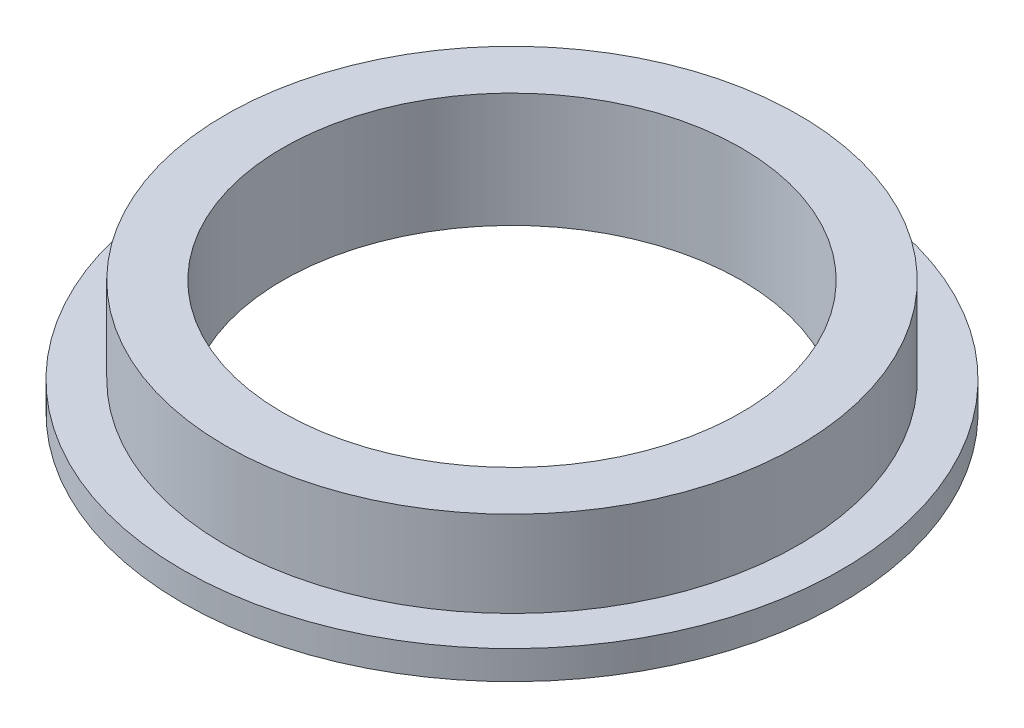
ISO-10303-21;
HEADER;
FILE_DESCRIPTION(('STEP AP214'),'2;1');
FILE_NAME('part.step','',(''),(''),'','','');
FILE_SCHEMA(('AUTOMOTIVE_DESIGN { 1 0 10303 214 1 1 1 1 }'));
ENDSEC;
DATA;
#1=APPLICATION_CONTEXT('core data for automotive mechanical design processes');
#2=APPLICATION_PROTOCOL_DEFINITION('international standard','automotive_design',2000,#1);
#3=PRODUCT_CONTEXT('',#1,'mechanical');
#4=PRODUCT('Part','Part','',(#3));
#5=PRODUCT_RELATED_PRODUCT_CATEGORY('part','',(#4));
#6=PRODUCT_DEFINITION_FORMATION('','',#4);
#7=PRODUCT_DEFINITION_CONTEXT('part definition',#1,'design');
#8=PRODUCT_DEFINITION('design','',#6,#7);
#9=PRODUCT_DEFINITION_SHAPE('','',#8);
#10=(LENGTH_UNIT() NAMED_UNIT(*) SI_UNIT(.MILLI.,.METRE.));
#11=(NAMED_UNIT(*) PLANE_ANGLE_UNIT() SI_UNIT($,.RADIAN.));
#12=(NAMED_UNIT(*) SI_UNIT($,.STERADIAN.) SOLID_ANGLE_UNIT());
#13=UNCERTAINTY_MEASURE_WITH_UNIT(LENGTH_MEASURE(1.E-05),#10,'distance_accuracy_value','');
#14=(GEOMETRIC_REPRESENTATION_CONTEXT(3) GLOBAL_UNCERTAINTY_ASSIGNED_CONTEXT((#13)) GLOBAL_UNIT_ASSIGNED_CONTEXT((#10,
#11,#12)) REPRESENTATION_CONTEXT('',''));
#15=CARTESIAN_POINT('',(0.,0.,0.));
#16=DIRECTION('',(0.,0.,1.));
#17=DIRECTION('',(1.,0.,0.));
#18=AXIS2_PLACEMENT_3D('',#15,#16,#17);
#19=CARTESIAN_POINT('',(0.,25.4,0.));
#20=DIRECTION('',(0.,-1.,0.));
#21=DIRECTION('',(0.,0.,-1.));
#22=AXIS2_PLACEMENT_3D('',#19,#20,#21);
#23=CYLINDRICAL_SURFACE('',#22,15.875);
#24=CARTESIAN_POINT('',(0.,1.5875,0.));
#25=DIRECTION('',(0.,1.,0.));
#26=DIRECTION('',(0.,0.,1.));
#27=AXIS2_PLACEMENT_3D('',#24,#25,#26);
#28=CIRCLE('',#27,15.875);
#29=CARTESIAN_POINT('',(0.,1.5875,15.875));
#30=VERTEX_POINT('',#29);
#31=EDGE_CURVE('E61',#30,#30,#28,.T.);
#32=ORIENTED_EDGE('',*,*,#31,.T.);
#33=EDGE_LOOP('',(#32));
#34=FACE_BOUND('',#33,.T.);
#35=CARTESIAN_POINT('',(0.,6.35,0.));
#36=DIRECTION('',(0.,1.,0.));
#37=DIRECTION('',(0.,0.,1.));
#38=AXIS2_PLACEMENT_3D('',#35,#36,#37);
#39=CIRCLE('',#38,15.875);
#40=CARTESIAN_POINT('',(0.,6.35,15.875));
#41=VERTEX_POINT('',#40);
#42=EDGE_CURVE('E66',#41,#41,#39,.T.);
#43=ORIENTED_EDGE('',*,*,#42,.F.);
#44=EDGE_LOOP('',(#43));
#45=FACE_BOUND('',#44,.T.);
#46=ADVANCED_FACE('F41',(#34,#45),#23,.T.);
#47=CARTESIAN_POINT('',(0.,25.4,0.));
#48=DIRECTION('',(0.,-1.,0.));
#49=DIRECTION('',(0.,0.,-1.));
#50=AXIS2_PLACEMENT_3D('',#47,#48,#49);
#51=CYLINDRICAL_SURFACE('',#50,12.7);
#52=CARTESIAN_POINT('',(0.,0.,0.));
#53=DIRECTION('',(0.,1.,0.));
#54=DIRECTION('',(0.,0.,1.));
#55=AXIS2_PLACEMENT_3D('',#52,#53,#54);
#56=CIRCLE('',#55,12.7);
#57=CARTESIAN_POINT('',(0.,0.,12.7));
#58=VERTEX_POINT('',#57);
#59=EDGE_CURVE('E12',#58,#58,#56,.T.);
#60=ORIENTED_EDGE('',*,*,#59,.F.);
#61=EDGE_LOOP('',(#60));
#62=FACE_BOUND('',#61,.T.);
#63=CARTESIAN_POINT('',(0.,6.35,0.));
#64=DIRECTION('',(0.,1.,0.));
#65=DIRECTION('',(0.,0.,1.));
#66=AXIS2_PLACEMENT_3D('',#63,#64,#65);
#67=CIRCLE('',#66,12.7);
#68=CARTESIAN_POINT('',(0.,6.35,12.7));
#69=VERTEX_POINT('',#68);
#70=EDGE_CURVE('E44',#69,#69,#67,.T.);
#71=ORIENTED_EDGE('',*,*,#70,.T.);
#72=EDGE_LOOP('',(#71));
#73=FACE_BOUND('',#72,.T.);
#74=ADVANCED_FACE('F73',(#62,#73),#51,.F.);
#75=CARTESIAN_POINT('',(0.,0.,0.));
#76=DIRECTION('',(0.,1.,0.));
#77=DIRECTION('',(0.,0.,1.));
#78=AXIS2_PLACEMENT_3D('',#75,#76,#77);
#79=PLANE('',#78);
#80=ORIENTED_EDGE('',*,*,#59,.T.);
#81=EDGE_LOOP('',(#80));
#82=FACE_BOUND('',#81,.T.);
#83=CARTESIAN_POINT('',(0.,0.,0.));
#84=DIRECTION('',(0.,1.,0.));
#85=DIRECTION('',(0.,0.,1.));
#86=AXIS2_PLACEMENT_3D('',#83,#84,#85);
#87=CIRCLE('',#86,18.25625);
#88=CARTESIAN_POINT('',(0.,0.,18.25625));
#89=VERTEX_POINT('',#88);
#90=EDGE_CURVE('E56',#89,#89,#87,.T.);
#91=ORIENTED_EDGE('',*,*,#90,.F.);
#92=EDGE_LOOP('',(#91));
#93=FACE_BOUND('',#92,.T.);
#94=ADVANCED_FACE('F91',(#82,#93),#79,.F.);
#95=CARTESIAN_POINT('',(0.,1.5875,0.));
#96=DIRECTION('',(0.,1.,0.));
#97=DIRECTION('',(0.,0.,1.));
#98=AXIS2_PLACEMENT_3D('',#95,#96,#97);
#99=PLANE('',#98);
#100=CARTESIAN_POINT('',(0.,1.5875,0.));
#101=DIRECTION('',(0.,1.,0.));
#102=DIRECTION('',(0.,0.,1.));
#103=AXIS2_PLACEMENT_3D('',#100,#101,#102);
#104=CIRCLE('',#103,18.25625);
#105=CARTESIAN_POINT('',(0.,1.5875,18.25625));
#106=VERTEX_POINT('',#105);
#107=EDGE_CURVE('E49',#106,#106,#104,.T.);
#108=ORIENTED_EDGE('',*,*,#107,.T.);
#109=EDGE_LOOP('',(#108));
#110=FACE_BOUND('',#109,.T.);
#111=ORIENTED_EDGE('',*,*,#31,.F.);
#112=EDGE_LOOP('',(#111));
#113=FACE_BOUND('',#112,.T.);
#114=ADVANCED_FACE('F82',(#110,#113),#99,.T.);
#115=CARTESIAN_POINT('',(0.,1.5875,0.));
#116=DIRECTION('',(0.,-1.,0.));
#117=DIRECTION('',(0.,0.,-1.));
#118=AXIS2_PLACEMENT_3D('',#115,#116,#117);
#119=CYLINDRICAL_SURFACE('',#118,18.25625);
#120=ORIENTED_EDGE('',*,*,#107,.F.);
#121=EDGE_LOOP('',(#120));
#122=FACE_BOUND('',#121,.T.);
#123=ORIENTED_EDGE('',*,*,#90,.T.);
#124=EDGE_LOOP('',(#123));
#125=FACE_BOUND('',#124,.T.);
#126=ADVANCED_FACE('F77',(#122,#125),#119,.T.);
#127=CARTESIAN_POINT('',(0.,6.35,0.));
#128=DIRECTION('',(0.,1.,0.));
#129=DIRECTION('',(0.,0.,1.));
#130=AXIS2_PLACEMENT_3D('',#127,#128,#129);
#131=PLANE('',#130);
#132=ORIENTED_EDGE('',*,*,#70,.F.);
#133=EDGE_LOOP('',(#132));
#134=FACE_BOUND('',#133,.T.);
#135=ORIENTED_EDGE('',*,*,#42,.T.);
#136=EDGE_LOOP('',(#135));
#137=FACE_BOUND('',#136,.T.);
#138=ADVANCED_FACE('F75',(#134,#137),#131,.T.);
#139=CLOSED_SHELL('',(#46,#74,#94,#114,#126,#138));
#140=MANIFOLD_SOLID_BREP('B2',#139);
#141=ADVANCED_BREP_SHAPE_REPRESENTATION('',(#18,#140),#14);
#142=SHAPE_DEFINITION_REPRESENTATION(#9,#141);
ENDSEC;
END-ISO-10303-21;
